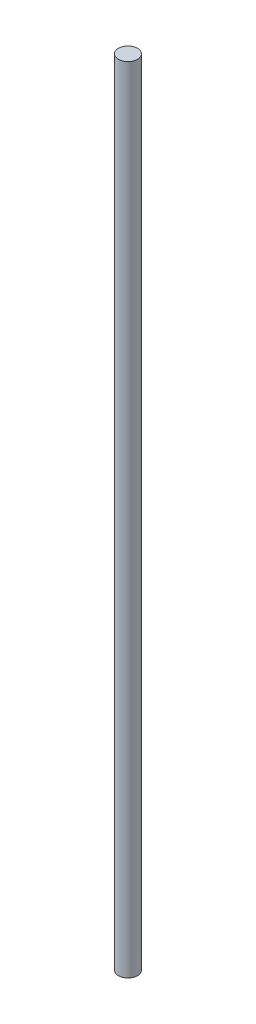
ISO-10303-21;
HEADER;
FILE_DESCRIPTION(('STEP AP214'),'2;1');
FILE_NAME('part.step','',(''),(''),'','','');
FILE_SCHEMA(('AUTOMOTIVE_DESIGN { 1 0 10303 214 1 1 1 1 }'));
ENDSEC;
DATA;
#1=APPLICATION_CONTEXT('core data for automotive mechanical design processes');
#2=APPLICATION_PROTOCOL_DEFINITION('international standard','automotive_design',2000,#1);
#3=PRODUCT_CONTEXT('',#1,'mechanical');
#4=PRODUCT('Part','Part','',(#3));
#5=PRODUCT_RELATED_PRODUCT_CATEGORY('part','',(#4));
#6=PRODUCT_DEFINITION_FORMATION('','',#4);
#7=PRODUCT_DEFINITION_CONTEXT('part definition',#1,'design');
#8=PRODUCT_DEFINITION('design','',#6,#7);
#9=PRODUCT_DEFINITION_SHAPE('','',#8);
#10=(LENGTH_UNIT() NAMED_UNIT(*) SI_UNIT(.MILLI.,.METRE.));
#11=(NAMED_UNIT(*) PLANE_ANGLE_UNIT() SI_UNIT($,.RADIAN.));
#12=(NAMED_UNIT(*) SI_UNIT($,.STERADIAN.) SOLID_ANGLE_UNIT());
#13=UNCERTAINTY_MEASURE_WITH_UNIT(LENGTH_MEASURE(1.E-05),#10,'distance_accuracy_value','');
#14=(GEOMETRIC_REPRESENTATION_CONTEXT(3) GLOBAL_UNCERTAINTY_ASSIGNED_CONTEXT((#13)) GLOBAL_UNIT_ASSIGNED_CONTEXT((#10,
#11,#12)) REPRESENTATION_CONTEXT('',''));
#15=CARTESIAN_POINT('',(0.,0.,0.));
#16=DIRECTION('',(0.,0.,1.));
#17=DIRECTION('',(1.,0.,0.));
#18=AXIS2_PLACEMENT_3D('',#15,#16,#17);
#19=CARTESIAN_POINT('',(0.,332.21,0.));
#20=DIRECTION('',(0.,-1.,0.));
#21=DIRECTION('',(0.,0.,-1.));
#22=AXIS2_PLACEMENT_3D('',#19,#20,#21);
#23=CYLINDRICAL_SURFACE('',#22,4.);
#24=CARTESIAN_POINT('',(0.,332.21,0.));
#25=DIRECTION('',(0.,1.,0.));
#26=DIRECTION('',(0.,0.,1.));
#27=AXIS2_PLACEMENT_3D('',#24,#25,#26);
#28=CIRCLE('',#27,4.);
#29=CARTESIAN_POINT('',(0.,332.21,4.));
#30=VERTEX_POINT('',#29);
#31=EDGE_CURVE('E10',#30,#30,#28,.T.);
#32=ORIENTED_EDGE('',*,*,#31,.F.);
#33=EDGE_LOOP('',(#32));
#34=FACE_BOUND('',#33,.T.);
#35=CARTESIAN_POINT('',(0.,0.,0.));
#36=DIRECTION('',(0.,1.,0.));
#37=DIRECTION('',(0.,0.,1.));
#38=AXIS2_PLACEMENT_3D('',#35,#36,#37);
#39=CIRCLE('',#38,4.);
#40=CARTESIAN_POINT('',(0.,0.,4.));
#41=VERTEX_POINT('',#40);
#42=EDGE_CURVE('E34',#41,#41,#39,.T.);
#43=ORIENTED_EDGE('',*,*,#42,.T.);
#44=EDGE_LOOP('',(#43));
#45=FACE_BOUND('',#44,.T.);
#46=ADVANCED_FACE('F31',(#34,#45),#23,.T.);
#47=CARTESIAN_POINT('',(0.,332.21,0.));
#48=DIRECTION('',(0.,1.,0.));
#49=DIRECTION('',(0.,0.,1.));
#50=AXIS2_PLACEMENT_3D('',#47,#48,#49);
#51=PLANE('',#50);
#52=ORIENTED_EDGE('',*,*,#31,.T.);
#53=EDGE_LOOP('',(#52));
#54=FACE_BOUND('',#53,.T.);
#55=ADVANCED_FACE('F46',(#54),#51,.T.);
#56=CARTESIAN_POINT('',(0.,0.,0.));
#57=DIRECTION('',(0.,1.,0.));
#58=DIRECTION('',(0.,0.,1.));
#59=AXIS2_PLACEMENT_3D('',#56,#57,#58);
#60=PLANE('',#59);
#61=ORIENTED_EDGE('',*,*,#42,.F.);
#62=EDGE_LOOP('',(#61));
#63=FACE_BOUND('',#62,.T.);
#64=ADVANCED_FACE('F44',(#63),#60,.F.);
#65=CLOSED_SHELL('',(#46,#55,#64));
#66=MANIFOLD_SOLID_BREP('B2',#65);
#67=ADVANCED_BREP_SHAPE_REPRESENTATION('',(#18,#66),#14);
#68=SHAPE_DEFINITION_REPRESENTATION(#9,#67);
ENDSEC;
END-ISO-10303-21;
